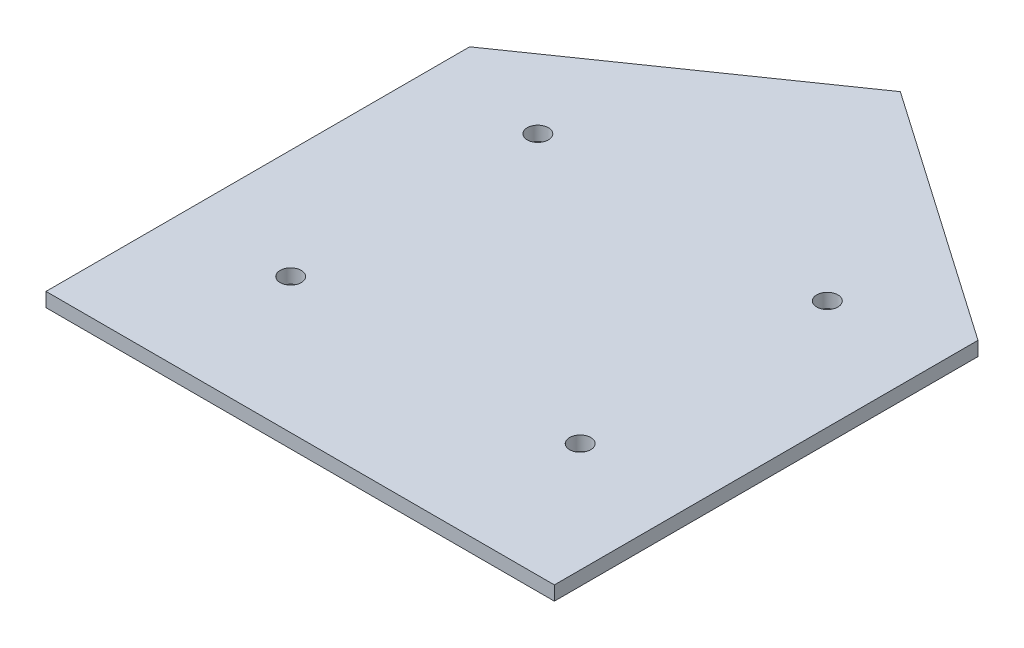
ISO-10303-21;
HEADER;
FILE_DESCRIPTION(('STEP AP214'),'2;1');
FILE_NAME('part.step','',(''),(''),'','','');
FILE_SCHEMA(('AUTOMOTIVE_DESIGN { 1 0 10303 214 1 1 1 1 }'));
ENDSEC;
DATA;
#1=APPLICATION_CONTEXT('core data for automotive mechanical design processes');
#2=APPLICATION_PROTOCOL_DEFINITION('international standard','automotive_design',2000,#1);
#3=PRODUCT_CONTEXT('',#1,'mechanical');
#4=PRODUCT('Part','Part','',(#3));
#5=PRODUCT_RELATED_PRODUCT_CATEGORY('part','',(#4));
#6=PRODUCT_DEFINITION_FORMATION('','',#4);
#7=PRODUCT_DEFINITION_CONTEXT('part definition',#1,'design');
#8=PRODUCT_DEFINITION('design','',#6,#7);
#9=PRODUCT_DEFINITION_SHAPE('','',#8);
#10=(LENGTH_UNIT() NAMED_UNIT(*) SI_UNIT(.MILLI.,.METRE.));
#11=(NAMED_UNIT(*) PLANE_ANGLE_UNIT() SI_UNIT($,.RADIAN.));
#12=(NAMED_UNIT(*) SI_UNIT($,.STERADIAN.) SOLID_ANGLE_UNIT());
#13=UNCERTAINTY_MEASURE_WITH_UNIT(LENGTH_MEASURE(1.E-05),#10,'distance_accuracy_value','');
#14=(GEOMETRIC_REPRESENTATION_CONTEXT(3) GLOBAL_UNCERTAINTY_ASSIGNED_CONTEXT((#13)) GLOBAL_UNIT_ASSIGNED_CONTEXT((#10,
#11,#12)) REPRESENTATION_CONTEXT('',''));
#15=CARTESIAN_POINT('',(0.,0.,0.));
#16=DIRECTION('',(0.,0.,1.));
#17=DIRECTION('',(1.,0.,0.));
#18=AXIS2_PLACEMENT_3D('',#15,#16,#17);
#19=CARTESIAN_POINT('',(0.,2.,0.));
#20=DIRECTION('',(0.,1.,0.));
#21=DIRECTION('',(0.,0.,1.));
#22=AXIS2_PLACEMENT_3D('',#19,#20,#21);
#23=PLANE('',#22);
#24=CARTESIAN_POINT('',(20.5,2.,10.8426700618104));
#25=DIRECTION('',(0.,1.,0.));
#26=DIRECTION('',(0.,0.,1.));
#27=AXIS2_PLACEMENT_3D('',#24,#25,#26);
#28=CIRCLE('',#27,1.5);
#29=CARTESIAN_POINT('',(20.5,2.,12.3426700618104));
#30=VERTEX_POINT('',#29);
#31=EDGE_CURVE('E193',#30,#30,#28,.T.);
#32=ORIENTED_EDGE('',*,*,#31,.F.);
#33=EDGE_LOOP('',(#32));
#34=FACE_BOUND('',#33,.T.);
#35=CARTESIAN_POINT('',(-20.5,2.,-24.1573299381896));
#36=DIRECTION('',(0.,1.,0.));
#37=DIRECTION('',(0.,0.,1.));
#38=AXIS2_PLACEMENT_3D('',#35,#36,#37);
#39=CIRCLE('',#38,1.5);
#40=CARTESIAN_POINT('',(-20.5,2.,-22.6573299381896));
#41=VERTEX_POINT('',#40);
#42=EDGE_CURVE('E124',#41,#41,#39,.T.);
#43=ORIENTED_EDGE('',*,*,#42,.F.);
#44=EDGE_LOOP('',(#43));
#45=FACE_BOUND('',#44,.T.);
#46=DIRECTION('',(-0.821369965673296,0.,-0.570395809495344));
#47=VECTOR('',#46,1.);
#48=CARTESIAN_POINT('',(0.,2.,-55.));
#49=LINE('',#48,#47);
#50=CARTESIAN_POINT('',(36.,2.,-30.));
#51=VERTEX_POINT('',#50);
#52=CARTESIAN_POINT('',(0.,2.,-55.));
#53=VERTEX_POINT('',#52);
#54=EDGE_CURVE('E133',#51,#53,#49,.T.);
#55=ORIENTED_EDGE('',*,*,#54,.T.);
#56=DIRECTION('',(-0.821369965673296,0.,0.570395809495344));
#57=VECTOR('',#56,1.);
#58=CARTESIAN_POINT('',(-36.,2.,-30.));
#59=LINE('',#58,#57);
#60=CARTESIAN_POINT('',(-36.,2.,-30.));
#61=VERTEX_POINT('',#60);
#62=EDGE_CURVE('E91',#53,#61,#59,.T.);
#63=ORIENTED_EDGE('',*,*,#62,.T.);
#64=DIRECTION('',(0.,0.,1.));
#65=VECTOR('',#64,1.);
#66=CARTESIAN_POINT('',(-36.,2.,30.));
#67=LINE('',#66,#65);
#68=CARTESIAN_POINT('',(-36.,2.,30.));
#69=VERTEX_POINT('',#68);
#70=EDGE_CURVE('E95',#61,#69,#67,.T.);
#71=ORIENTED_EDGE('',*,*,#70,.T.);
#72=DIRECTION('',(1.,0.,0.));
#73=VECTOR('',#72,1.);
#74=CARTESIAN_POINT('',(-36.,2.,30.));
#75=LINE('',#74,#73);
#76=CARTESIAN_POINT('',(36.,2.,30.));
#77=VERTEX_POINT('',#76);
#78=EDGE_CURVE('E99',#69,#77,#75,.T.);
#79=ORIENTED_EDGE('',*,*,#78,.T.);
#80=DIRECTION('',(0.,0.,-1.));
#81=VECTOR('',#80,1.);
#82=CARTESIAN_POINT('',(36.,2.,30.));
#83=LINE('',#82,#81);
#84=EDGE_CURVE('E57',#77,#51,#83,.T.);
#85=ORIENTED_EDGE('',*,*,#84,.T.);
#86=EDGE_LOOP('',(#55,#63,#71,#79,#85));
#87=FACE_BOUND('',#86,.T.);
#88=CARTESIAN_POINT('',(20.5,2.,-24.1573299381896));
#89=DIRECTION('',(0.,1.,0.));
#90=DIRECTION('',(0.,0.,1.));
#91=AXIS2_PLACEMENT_3D('',#88,#89,#90);
#92=CIRCLE('',#91,1.5);
#93=CARTESIAN_POINT('',(20.5,2.,-22.6573299381896));
#94=VERTEX_POINT('',#93);
#95=EDGE_CURVE('E201',#94,#94,#92,.T.);
#96=ORIENTED_EDGE('',*,*,#95,.F.);
#97=EDGE_LOOP('',(#96));
#98=FACE_BOUND('',#97,.T.);
#99=CARTESIAN_POINT('',(-20.5,2.,10.8426700618104));
#100=DIRECTION('',(0.,1.,0.));
#101=DIRECTION('',(0.,0.,1.));
#102=AXIS2_PLACEMENT_3D('',#99,#100,#101);
#103=CIRCLE('',#102,1.5);
#104=CARTESIAN_POINT('',(-20.5,2.,12.3426700618104));
#105=VERTEX_POINT('',#104);
#106=EDGE_CURVE('E182',#105,#105,#103,.T.);
#107=ORIENTED_EDGE('',*,*,#106,.F.);
#108=EDGE_LOOP('',(#107));
#109=FACE_BOUND('',#108,.T.);
#110=ADVANCED_FACE('F39',(#34,#45,#87,#98,#109),#23,.T.);
#111=CARTESIAN_POINT('',(0.,0.,0.));
#112=DIRECTION('',(0.,1.,0.));
#113=DIRECTION('',(0.,0.,1.));
#114=AXIS2_PLACEMENT_3D('',#111,#112,#113);
#115=PLANE('',#114);
#116=DIRECTION('',(-0.821369965673296,0.,-0.570395809495344));
#117=VECTOR('',#116,1.);
#118=CARTESIAN_POINT('',(0.,0.,-55.));
#119=LINE('',#118,#117);
#120=CARTESIAN_POINT('',(36.,0.,-30.));
#121=VERTEX_POINT('',#120);
#122=CARTESIAN_POINT('',(0.,0.,-55.));
#123=VERTEX_POINT('',#122);
#124=EDGE_CURVE('E119',#121,#123,#119,.T.);
#125=ORIENTED_EDGE('',*,*,#124,.F.);
#126=DIRECTION('',(0.,0.,-1.));
#127=VECTOR('',#126,1.);
#128=CARTESIAN_POINT('',(36.,0.,30.));
#129=LINE('',#128,#127);
#130=CARTESIAN_POINT('',(36.,0.,30.));
#131=VERTEX_POINT('',#130);
#132=EDGE_CURVE('E83',#131,#121,#129,.T.);
#133=ORIENTED_EDGE('',*,*,#132,.F.);
#134=DIRECTION('',(1.,0.,0.));
#135=VECTOR('',#134,1.);
#136=CARTESIAN_POINT('',(-36.,0.,30.));
#137=LINE('',#136,#135);
#138=CARTESIAN_POINT('',(-36.,0.,30.));
#139=VERTEX_POINT('',#138);
#140=EDGE_CURVE('E77',#139,#131,#137,.T.);
#141=ORIENTED_EDGE('',*,*,#140,.F.);
#142=DIRECTION('',(0.,0.,1.));
#143=VECTOR('',#142,1.);
#144=CARTESIAN_POINT('',(-36.,0.,30.));
#145=LINE('',#144,#143);
#146=CARTESIAN_POINT('',(-36.,0.,-30.));
#147=VERTEX_POINT('',#146);
#148=EDGE_CURVE('E107',#147,#139,#145,.T.);
#149=ORIENTED_EDGE('',*,*,#148,.F.);
#150=DIRECTION('',(-0.821369965673296,0.,0.570395809495344));
#151=VECTOR('',#150,1.);
#152=CARTESIAN_POINT('',(-36.,0.,-30.));
#153=LINE('',#152,#151);
#154=EDGE_CURVE('E123',#123,#147,#153,.T.);
#155=ORIENTED_EDGE('',*,*,#154,.F.);
#156=EDGE_LOOP('',(#125,#133,#141,#149,#155));
#157=FACE_BOUND('',#156,.T.);
#158=CARTESIAN_POINT('',(-20.5,0.,-24.1573299381896));
#159=DIRECTION('',(0.,1.,0.));
#160=DIRECTION('',(0.,0.,1.));
#161=AXIS2_PLACEMENT_3D('',#158,#159,#160);
#162=CIRCLE('',#161,1.5);
#163=CARTESIAN_POINT('',(-20.5,0.,-22.6573299381896));
#164=VERTEX_POINT('',#163);
#165=EDGE_CURVE('E205',#164,#164,#162,.T.);
#166=ORIENTED_EDGE('',*,*,#165,.T.);
#167=EDGE_LOOP('',(#166));
#168=FACE_BOUND('',#167,.T.);
#169=CARTESIAN_POINT('',(20.5,0.,-24.1573299381896));
#170=DIRECTION('',(0.,1.,0.));
#171=DIRECTION('',(0.,0.,1.));
#172=AXIS2_PLACEMENT_3D('',#169,#170,#171);
#173=CIRCLE('',#172,1.5);
#174=CARTESIAN_POINT('',(20.5,0.,-22.6573299381896));
#175=VERTEX_POINT('',#174);
#176=EDGE_CURVE('E197',#175,#175,#173,.T.);
#177=ORIENTED_EDGE('',*,*,#176,.T.);
#178=EDGE_LOOP('',(#177));
#179=FACE_BOUND('',#178,.T.);
#180=CARTESIAN_POINT('',(20.5,0.,10.8426700618104));
#181=DIRECTION('',(0.,1.,0.));
#182=DIRECTION('',(0.,0.,1.));
#183=AXIS2_PLACEMENT_3D('',#180,#181,#182);
#184=CIRCLE('',#183,1.5);
#185=CARTESIAN_POINT('',(20.5,0.,12.3426700618104));
#186=VERTEX_POINT('',#185);
#187=EDGE_CURVE('E190',#186,#186,#184,.T.);
#188=ORIENTED_EDGE('',*,*,#187,.T.);
#189=EDGE_LOOP('',(#188));
#190=FACE_BOUND('',#189,.T.);
#191=CARTESIAN_POINT('',(-20.5,0.,10.8426700618104));
#192=DIRECTION('',(0.,1.,0.));
#193=DIRECTION('',(0.,0.,1.));
#194=AXIS2_PLACEMENT_3D('',#191,#192,#193);
#195=CIRCLE('',#194,1.5);
#196=CARTESIAN_POINT('',(-20.5,0.,12.3426700618104));
#197=VERTEX_POINT('',#196);
#198=EDGE_CURVE('E185',#197,#197,#195,.T.);
#199=ORIENTED_EDGE('',*,*,#198,.T.);
#200=EDGE_LOOP('',(#199));
#201=FACE_BOUND('',#200,.T.);
#202=ADVANCED_FACE('F140',(#157,#168,#179,#190,#201),#115,.F.);
#203=CARTESIAN_POINT('',(0.,2.,-55.));
#204=DIRECTION('',(-0.570395809495344,0.,0.821369965673296));
#205=DIRECTION('',(0.821369965673296,0.,0.570395809495344));
#206=AXIS2_PLACEMENT_3D('',#203,#204,#205);
#207=PLANE('',#206);
#208=ORIENTED_EDGE('',*,*,#124,.T.);
#209=DIRECTION('',(0.,-1.,0.));
#210=VECTOR('',#209,1.);
#211=CARTESIAN_POINT('',(0.,2.,-55.));
#212=LINE('',#211,#210);
#213=EDGE_CURVE('E11',#53,#123,#212,.T.);
#214=ORIENTED_EDGE('',*,*,#213,.F.);
#215=ORIENTED_EDGE('',*,*,#54,.F.);
#216=DIRECTION('',(0.,-1.,0.));
#217=VECTOR('',#216,1.);
#218=CARTESIAN_POINT('',(36.,2.,-30.));
#219=LINE('',#218,#217);
#220=EDGE_CURVE('E115',#51,#121,#219,.T.);
#221=ORIENTED_EDGE('',*,*,#220,.T.);
#222=EDGE_LOOP('',(#208,#214,#215,#221));
#223=FACE_BOUND('',#222,.T.);
#224=ADVANCED_FACE('F41',(#223),#207,.F.);
#225=CARTESIAN_POINT('',(-36.,2.,-30.));
#226=DIRECTION('',(0.570395809495344,0.,0.821369965673296));
#227=DIRECTION('',(0.821369965673296,0.,-0.570395809495344));
#228=AXIS2_PLACEMENT_3D('',#225,#226,#227);
#229=PLANE('',#228);
#230=ORIENTED_EDGE('',*,*,#154,.T.);
#231=DIRECTION('',(0.,-1.,0.));
#232=VECTOR('',#231,1.);
#233=CARTESIAN_POINT('',(-36.,2.,-30.));
#234=LINE('',#233,#232);
#235=EDGE_CURVE('E49',#61,#147,#234,.T.);
#236=ORIENTED_EDGE('',*,*,#235,.F.);
#237=ORIENTED_EDGE('',*,*,#62,.F.);
#238=ORIENTED_EDGE('',*,*,#213,.T.);
#239=EDGE_LOOP('',(#230,#236,#237,#238));
#240=FACE_BOUND('',#239,.T.);
#241=ADVANCED_FACE('F259',(#240),#229,.F.);
#242=CARTESIAN_POINT('',(-36.,2.,30.));
#243=DIRECTION('',(1.,0.,0.));
#244=DIRECTION('',(0.,0.,-1.));
#245=AXIS2_PLACEMENT_3D('',#242,#243,#244);
#246=PLANE('',#245);
#247=ORIENTED_EDGE('',*,*,#148,.T.);
#248=DIRECTION('',(0.,-1.,0.));
#249=VECTOR('',#248,1.);
#250=CARTESIAN_POINT('',(-36.,2.,30.));
#251=LINE('',#250,#249);
#252=EDGE_CURVE('E104',#69,#139,#251,.T.);
#253=ORIENTED_EDGE('',*,*,#252,.F.);
#254=ORIENTED_EDGE('',*,*,#70,.F.);
#255=ORIENTED_EDGE('',*,*,#235,.T.);
#256=EDGE_LOOP('',(#247,#253,#254,#255));
#257=FACE_BOUND('',#256,.T.);
#258=ADVANCED_FACE('F105',(#257),#246,.F.);
#259=CARTESIAN_POINT('',(-36.,2.,30.));
#260=DIRECTION('',(0.,0.,-1.));
#261=DIRECTION('',(-1.,0.,0.));
#262=AXIS2_PLACEMENT_3D('',#259,#260,#261);
#263=PLANE('',#262);
#264=ORIENTED_EDGE('',*,*,#140,.T.);
#265=DIRECTION('',(0.,-1.,0.));
#266=VECTOR('',#265,1.);
#267=CARTESIAN_POINT('',(36.,2.,30.));
#268=LINE('',#267,#266);
#269=EDGE_CURVE('E109',#77,#131,#268,.T.);
#270=ORIENTED_EDGE('',*,*,#269,.F.);
#271=ORIENTED_EDGE('',*,*,#78,.F.);
#272=ORIENTED_EDGE('',*,*,#252,.T.);
#273=EDGE_LOOP('',(#264,#270,#271,#272));
#274=FACE_BOUND('',#273,.T.);
#275=ADVANCED_FACE('F111',(#274),#263,.F.);
#276=CARTESIAN_POINT('',(36.,2.,30.));
#277=DIRECTION('',(-1.,0.,0.));
#278=DIRECTION('',(0.,0.,1.));
#279=AXIS2_PLACEMENT_3D('',#276,#277,#278);
#280=PLANE('',#279);
#281=ORIENTED_EDGE('',*,*,#132,.T.);
#282=ORIENTED_EDGE('',*,*,#220,.F.);
#283=ORIENTED_EDGE('',*,*,#84,.F.);
#284=ORIENTED_EDGE('',*,*,#269,.T.);
#285=EDGE_LOOP('',(#281,#282,#283,#284));
#286=FACE_BOUND('',#285,.T.);
#287=ADVANCED_FACE('F145',(#286),#280,.F.);
#288=CARTESIAN_POINT('',(-20.5,2.,-24.1573299381896));
#289=DIRECTION('',(0.,-1.,0.));
#290=DIRECTION('',(0.,0.,-1.));
#291=AXIS2_PLACEMENT_3D('',#288,#289,#290);
#292=CYLINDRICAL_SURFACE('',#291,1.5);
#293=ORIENTED_EDGE('',*,*,#42,.T.);
#294=EDGE_LOOP('',(#293));
#295=FACE_BOUND('',#294,.T.);
#296=ORIENTED_EDGE('',*,*,#165,.F.);
#297=EDGE_LOOP('',(#296));
#298=FACE_BOUND('',#297,.T.);
#299=ADVANCED_FACE('F147',(#295,#298),#292,.F.);
#300=CARTESIAN_POINT('',(20.5,2.,-24.1573299381896));
#301=DIRECTION('',(0.,-1.,0.));
#302=DIRECTION('',(0.,0.,-1.));
#303=AXIS2_PLACEMENT_3D('',#300,#301,#302);
#304=CYLINDRICAL_SURFACE('',#303,1.5);
#305=ORIENTED_EDGE('',*,*,#95,.T.);
#306=EDGE_LOOP('',(#305));
#307=FACE_BOUND('',#306,.T.);
#308=ORIENTED_EDGE('',*,*,#176,.F.);
#309=EDGE_LOOP('',(#308));
#310=FACE_BOUND('',#309,.T.);
#311=ADVANCED_FACE('F153',(#307,#310),#304,.F.);
#312=CARTESIAN_POINT('',(20.5,2.,10.8426700618104));
#313=DIRECTION('',(0.,-1.,0.));
#314=DIRECTION('',(0.,0.,-1.));
#315=AXIS2_PLACEMENT_3D('',#312,#313,#314);
#316=CYLINDRICAL_SURFACE('',#315,1.5);
#317=ORIENTED_EDGE('',*,*,#31,.T.);
#318=EDGE_LOOP('',(#317));
#319=FACE_BOUND('',#318,.T.);
#320=ORIENTED_EDGE('',*,*,#187,.F.);
#321=EDGE_LOOP('',(#320));
#322=FACE_BOUND('',#321,.T.);
#323=ADVANCED_FACE('F169',(#319,#322),#316,.F.);
#324=CARTESIAN_POINT('',(-20.5,2.,10.8426700618104));
#325=DIRECTION('',(0.,-1.,0.));
#326=DIRECTION('',(0.,0.,-1.));
#327=AXIS2_PLACEMENT_3D('',#324,#325,#326);
#328=CYLINDRICAL_SURFACE('',#327,1.5);
#329=ORIENTED_EDGE('',*,*,#106,.T.);
#330=EDGE_LOOP('',(#329));
#331=FACE_BOUND('',#330,.T.);
#332=ORIENTED_EDGE('',*,*,#198,.F.);
#333=EDGE_LOOP('',(#332));
#334=FACE_BOUND('',#333,.T.);
#335=ADVANCED_FACE('F173',(#331,#334),#328,.F.);
#336=CLOSED_SHELL('',(#110,#202,#224,#241,#258,#275,#287,#299,#311,#323,#335));
#337=MANIFOLD_SOLID_BREP('B2',#336);
#338=ADVANCED_BREP_SHAPE_REPRESENTATION('',(#18,#337),#14);
#339=SHAPE_DEFINITION_REPRESENTATION(#9,#338);
ENDSEC;
END-ISO-10303-21;
